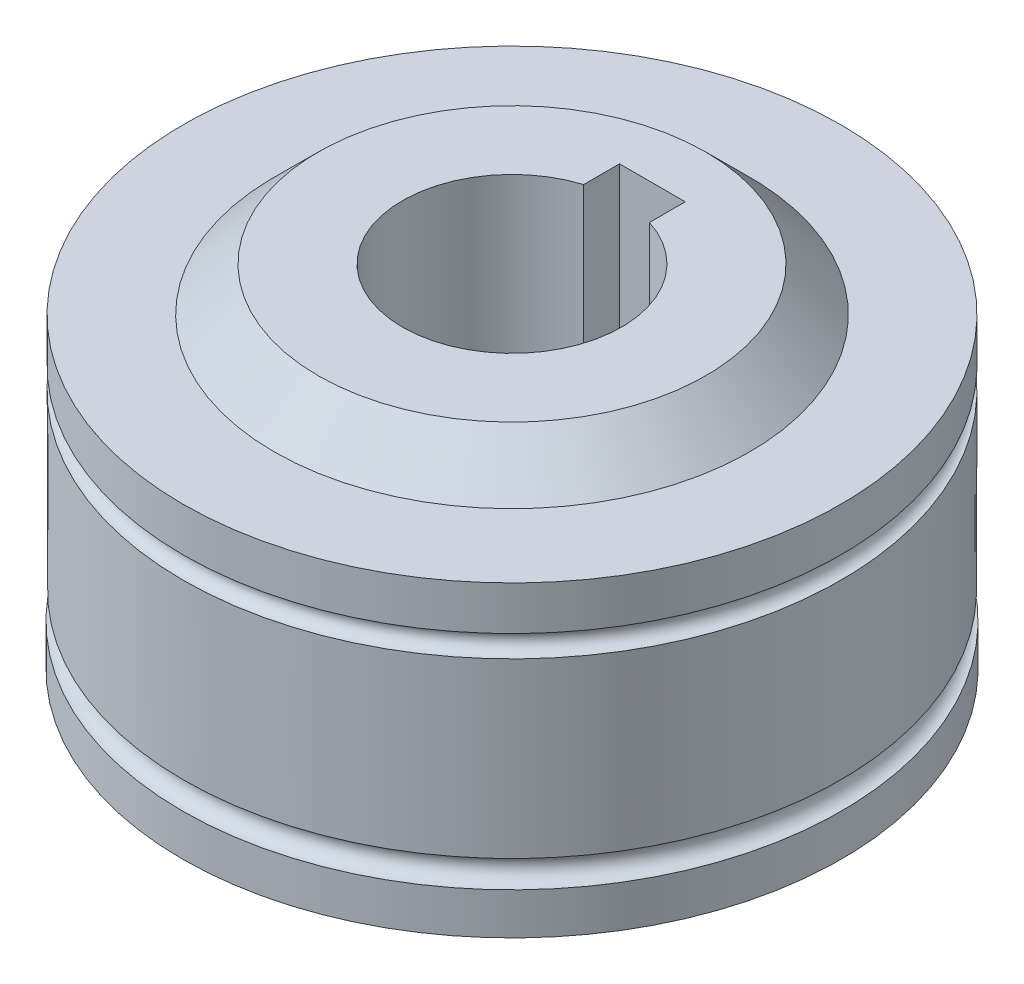
ISO-10303-21;
HEADER;
FILE_DESCRIPTION(('STEP AP214'),'2;1');
FILE_NAME('part.step','',(''),(''),'','','');
FILE_SCHEMA(('AUTOMOTIVE_DESIGN { 1 0 10303 214 1 1 1 1 }'));
ENDSEC;
DATA;
#1=APPLICATION_CONTEXT('core data for automotive mechanical design processes');
#2=APPLICATION_PROTOCOL_DEFINITION('international standard','automotive_design',2000,#1);
#3=PRODUCT_CONTEXT('',#1,'mechanical');
#4=PRODUCT('Part','Part','',(#3));
#5=PRODUCT_RELATED_PRODUCT_CATEGORY('part','',(#4));
#6=PRODUCT_DEFINITION_FORMATION('','',#4);
#7=PRODUCT_DEFINITION_CONTEXT('part definition',#1,'design');
#8=PRODUCT_DEFINITION('design','',#6,#7);
#9=PRODUCT_DEFINITION_SHAPE('','',#8);
#10=(LENGTH_UNIT() NAMED_UNIT(*) SI_UNIT(.MILLI.,.METRE.));
#11=(NAMED_UNIT(*) PLANE_ANGLE_UNIT() SI_UNIT($,.RADIAN.));
#12=(NAMED_UNIT(*) SI_UNIT($,.STERADIAN.) SOLID_ANGLE_UNIT());
#13=UNCERTAINTY_MEASURE_WITH_UNIT(LENGTH_MEASURE(1.E-05),#10,'distance_accuracy_value','');
#14=(GEOMETRIC_REPRESENTATION_CONTEXT(3) GLOBAL_UNCERTAINTY_ASSIGNED_CONTEXT((#13)) GLOBAL_UNIT_ASSIGNED_CONTEXT((#10,
#11,#12)) REPRESENTATION_CONTEXT('',''));
#15=CARTESIAN_POINT('',(0.,0.,0.));
#16=DIRECTION('',(0.,0.,1.));
#17=DIRECTION('',(1.,0.,0.));
#18=AXIS2_PLACEMENT_3D('',#15,#16,#17);
#19=CARTESIAN_POINT('',(0.,-9.,-8.84002342260273));
#20=DIRECTION('',(0.,-1.,0.));
#21=DIRECTION('',(0.,0.,-1.));
#22=AXIS2_PLACEMENT_3D('',#19,#20,#21);
#23=PLANE('',#22);
#24=DIRECTION('',(0.,0.,1.));
#25=VECTOR('',#24,1.);
#26=CARTESIAN_POINT('',(-1.5,-9.,-4.));
#27=LINE('',#26,#25);
#28=CARTESIAN_POINT('',(-1.5,-9.,-6.4056612472711));
#29=VERTEX_POINT('',#28);
#30=CARTESIAN_POINT('',(-1.5,-9.,-4.76969600708473));
#31=VERTEX_POINT('',#30);
#32=EDGE_CURVE('E93',#29,#31,#27,.T.);
#33=ORIENTED_EDGE('',*,*,#32,.T.);
#34=CARTESIAN_POINT('',(0.,-9.,0.));
#35=DIRECTION('',(0.,1.,0.));
#36=DIRECTION('',(0.,0.,1.));
#37=AXIS2_PLACEMENT_3D('',#34,#35,#36);
#38=CIRCLE('',#37,5.);
#39=CARTESIAN_POINT('',(1.5,-9.,-4.76969600708473));
#40=VERTEX_POINT('',#39);
#41=EDGE_CURVE('E103',#31,#40,#38,.T.);
#42=ORIENTED_EDGE('',*,*,#41,.T.);
#43=DIRECTION('',(0.,0.,-1.));
#44=VECTOR('',#43,1.);
#45=CARTESIAN_POINT('',(1.5,-9.,-6.4056612472711));
#46=LINE('',#45,#44);
#47=CARTESIAN_POINT('',(1.5,-9.,-6.4056612472711));
#48=VERTEX_POINT('',#47);
#49=EDGE_CURVE('E61',#40,#48,#46,.T.);
#50=ORIENTED_EDGE('',*,*,#49,.T.);
#51=DIRECTION('',(-1.,0.,0.));
#52=VECTOR('',#51,1.);
#53=CARTESIAN_POINT('',(-1.5,-9.,-6.4056612472711));
#54=LINE('',#53,#52);
#55=EDGE_CURVE('E96',#48,#29,#54,.T.);
#56=ORIENTED_EDGE('',*,*,#55,.T.);
#57=EDGE_LOOP('',(#33,#42,#50,#56));
#58=FACE_BOUND('',#57,.T.);
#59=CARTESIAN_POINT('',(0.,-8.99999999999999,0.));
#60=DIRECTION('',(0.,1.,0.));
#61=DIRECTION('',(0.,0.,1.));
#62=AXIS2_PLACEMENT_3D('',#59,#60,#61);
#63=CIRCLE('',#62,8.84002342260272);
#64=CARTESIAN_POINT('',(0.,-9.,8.84002342260272));
#65=VERTEX_POINT('',#64);
#66=EDGE_CURVE('E144',#65,#65,#63,.T.);
#67=ORIENTED_EDGE('',*,*,#66,.F.);
#68=EDGE_LOOP('',(#67));
#69=FACE_BOUND('',#68,.T.);
#70=ADVANCED_FACE('F47',(#58,#69),#23,.T.);
#71=CARTESIAN_POINT('',(0.,-7.,0.));
#72=DIRECTION('',(0.,1.,0.));
#73=DIRECTION('',(0.,0.,1.));
#74=AXIS2_PLACEMENT_3D('',#71,#72,#73);
#75=CONICAL_SURFACE('',#74,10.8508824151108,0.788105555005152);
#76=ORIENTED_EDGE('',*,*,#66,.T.);
#77=EDGE_LOOP('',(#76));
#78=FACE_BOUND('',#77,.T.);
#79=CARTESIAN_POINT('',(0.,-7.,0.));
#80=DIRECTION('',(0.,1.,0.));
#81=DIRECTION('',(0.,0.,1.));
#82=AXIS2_PLACEMENT_3D('',#79,#80,#81);
#83=CIRCLE('',#82,10.8508824151108);
#84=CARTESIAN_POINT('',(0.,-7.,10.8508824151108));
#85=VERTEX_POINT('',#84);
#86=EDGE_CURVE('E141',#85,#85,#83,.T.);
#87=ORIENTED_EDGE('',*,*,#86,.F.);
#88=EDGE_LOOP('',(#87));
#89=FACE_BOUND('',#88,.T.);
#90=ADVANCED_FACE('F165',(#78,#89),#75,.T.);
#91=CARTESIAN_POINT('',(0.,-7.,-15.0346090625599));
#92=DIRECTION('',(0.,-1.,0.));
#93=DIRECTION('',(0.,0.,-1.));
#94=AXIS2_PLACEMENT_3D('',#91,#92,#93);
#95=PLANE('',#94);
#96=ORIENTED_EDGE('',*,*,#86,.T.);
#97=EDGE_LOOP('',(#96));
#98=FACE_BOUND('',#97,.T.);
#99=CARTESIAN_POINT('',(0.,-7.,0.));
#100=DIRECTION('',(0.,1.,0.));
#101=DIRECTION('',(0.,0.,1.));
#102=AXIS2_PLACEMENT_3D('',#99,#100,#101);
#103=CIRCLE('',#102,15.0346090625599);
#104=CARTESIAN_POINT('',(0.,-7.,15.0346090625599));
#105=VERTEX_POINT('',#104);
#106=EDGE_CURVE('E138',#105,#105,#103,.T.);
#107=ORIENTED_EDGE('',*,*,#106,.F.);
#108=EDGE_LOOP('',(#107));
#109=FACE_BOUND('',#108,.T.);
#110=ADVANCED_FACE('F169',(#98,#109),#95,.T.);
#111=CARTESIAN_POINT('',(0.,26.6331730643921,0.));
#112=DIRECTION('',(0.,1.,0.));
#113=DIRECTION('',(0.,0.,1.));
#114=AXIS2_PLACEMENT_3D('',#111,#112,#113);
#115=CYLINDRICAL_SURFACE('',#114,15.0346090625599);
#116=CARTESIAN_POINT('',(0.,-5.09943827429824,0.));
#117=DIRECTION('',(0.,1.,0.));
#118=DIRECTION('',(0.,0.,1.));
#119=AXIS2_PLACEMENT_3D('',#116,#117,#118);
#120=CIRCLE('',#119,15.0346090625599);
#121=CARTESIAN_POINT('',(0.,-5.09943827429824,15.0346090625599));
#122=VERTEX_POINT('',#121);
#123=EDGE_CURVE('E135',#122,#122,#120,.T.);
#124=ORIENTED_EDGE('',*,*,#123,.F.);
#125=EDGE_LOOP('',(#124));
#126=FACE_BOUND('',#125,.T.);
#127=ORIENTED_EDGE('',*,*,#106,.T.);
#128=EDGE_LOOP('',(#127));
#129=FACE_BOUND('',#128,.T.);
#130=ADVANCED_FACE('F174',(#126,#129),#115,.T.);
#131=CARTESIAN_POINT('',(0.,-4.5,0.));
#132=DIRECTION('',(0.,1.,0.));
#133=DIRECTION('',(0.,0.,1.));
#134=AXIS2_PLACEMENT_3D('',#131,#132,#133);
#135=TOROIDAL_SURFACE('',#134,15.00865226564,0.600000000000001);
#136=CARTESIAN_POINT('',(0.,-3.90056172570176,0.));
#137=DIRECTION('',(0.,1.,0.));
#138=DIRECTION('',(0.,0.,1.));
#139=AXIS2_PLACEMENT_3D('',#136,#137,#138);
#140=CIRCLE('',#139,14.98269546872);
#141=CARTESIAN_POINT('',(0.,-3.90056172570176,14.98269546872));
#142=VERTEX_POINT('',#141);
#143=EDGE_CURVE('E132',#142,#142,#140,.T.);
#144=ORIENTED_EDGE('',*,*,#143,.F.);
#145=EDGE_LOOP('',(#144));
#146=FACE_BOUND('',#145,.T.);
#147=ORIENTED_EDGE('',*,*,#123,.T.);
#148=EDGE_LOOP('',(#147));
#149=FACE_BOUND('',#148,.T.);
#150=ADVANCED_FACE('F181',(#146,#149),#135,.F.);
#151=CARTESIAN_POINT('',(0.,4.,0.));
#152=DIRECTION('',(0.,1.,0.));
#153=DIRECTION('',(0.,0.,1.));
#154=AXIS2_PLACEMENT_3D('',#151,#152,#153);
#155=CONICAL_SURFACE('',#154,15.,0.00219028775531847);
#156=ORIENTED_EDGE('',*,*,#143,.T.);
#157=EDGE_LOOP('',(#156));
#158=FACE_BOUND('',#157,.T.);
#159=CARTESIAN_POINT('',(0.,4.,0.));
#160=DIRECTION('',(0.,1.,0.));
#161=DIRECTION('',(0.,0.,1.));
#162=AXIS2_PLACEMENT_3D('',#159,#160,#161);
#163=CIRCLE('',#162,15.);
#164=CARTESIAN_POINT('',(0.,3.99999999999999,15.));
#165=VERTEX_POINT('',#164);
#166=EDGE_CURVE('E129',#165,#165,#163,.T.);
#167=ORIENTED_EDGE('',*,*,#166,.F.);
#168=EDGE_LOOP('',(#167));
#169=FACE_BOUND('',#168,.T.);
#170=ADVANCED_FACE('F185',(#158,#169),#155,.T.);
#171=CARTESIAN_POINT('',(0.,4.5,0.));
#172=DIRECTION('',(0.,1.,0.));
#173=DIRECTION('',(0.,0.,1.));
#174=AXIS2_PLACEMENT_3D('',#171,#172,#173);
#175=TOROIDAL_SURFACE('',#174,15.,0.5);
#176=ORIENTED_EDGE('',*,*,#166,.T.);
#177=EDGE_LOOP('',(#176));
#178=FACE_BOUND('',#177,.T.);
#179=CARTESIAN_POINT('',(0.,4.99999999999999,0.));
#180=DIRECTION('',(0.,1.,0.));
#181=DIRECTION('',(0.,0.,1.));
#182=AXIS2_PLACEMENT_3D('',#179,#180,#181);
#183=CIRCLE('',#182,15.);
#184=CARTESIAN_POINT('',(0.,4.99999999999999,15.));
#185=VERTEX_POINT('',#184);
#186=EDGE_CURVE('E126',#185,#185,#183,.T.);
#187=ORIENTED_EDGE('',*,*,#186,.F.);
#188=EDGE_LOOP('',(#187));
#189=FACE_BOUND('',#188,.T.);
#190=ADVANCED_FACE('F189',(#178,#189),#175,.F.);
#191=CARTESIAN_POINT('',(0.,26.6331730643921,0.));
#192=DIRECTION('',(0.,1.,0.));
#193=DIRECTION('',(0.,0.,1.));
#194=AXIS2_PLACEMENT_3D('',#191,#192,#193);
#195=CYLINDRICAL_SURFACE('',#194,15.);
#196=ORIENTED_EDGE('',*,*,#186,.T.);
#197=EDGE_LOOP('',(#196));
#198=FACE_BOUND('',#197,.T.);
#199=CARTESIAN_POINT('',(0.,7.,0.));
#200=DIRECTION('',(0.,1.,0.));
#201=DIRECTION('',(0.,0.,1.));
#202=AXIS2_PLACEMENT_3D('',#199,#200,#201);
#203=CIRCLE('',#202,15.);
#204=CARTESIAN_POINT('',(0.,6.99999999999999,15.));
#205=VERTEX_POINT('',#204);
#206=EDGE_CURVE('E123',#205,#205,#203,.T.);
#207=ORIENTED_EDGE('',*,*,#206,.F.);
#208=EDGE_LOOP('',(#207));
#209=FACE_BOUND('',#208,.T.);
#210=ADVANCED_FACE('F193',(#198,#209),#195,.T.);
#211=CARTESIAN_POINT('',(0.,7.,-15.));
#212=DIRECTION('',(0.,-1.,0.));
#213=DIRECTION('',(0.,0.,-1.));
#214=AXIS2_PLACEMENT_3D('',#211,#212,#213);
#215=PLANE('',#214);
#216=CARTESIAN_POINT('',(0.,7.,0.));
#217=DIRECTION('',(0.,1.,0.));
#218=DIRECTION('',(0.,0.,1.));
#219=AXIS2_PLACEMENT_3D('',#216,#217,#218);
#220=CIRCLE('',#219,10.8508824151108);
#221=CARTESIAN_POINT('',(0.,7.,10.8508824151108));
#222=VERTEX_POINT('',#221);
#223=EDGE_CURVE('E120',#222,#222,#220,.T.);
#224=ORIENTED_EDGE('',*,*,#223,.F.);
#225=EDGE_LOOP('',(#224));
#226=FACE_BOUND('',#225,.T.);
#227=ORIENTED_EDGE('',*,*,#206,.T.);
#228=EDGE_LOOP('',(#227));
#229=FACE_BOUND('',#228,.T.);
#230=ADVANCED_FACE('F197',(#226,#229),#215,.F.);
#231=CARTESIAN_POINT('',(0.,7.,0.));
#232=DIRECTION('',(0.,-1.,0.));
#233=DIRECTION('',(0.,0.,-1.));
#234=AXIS2_PLACEMENT_3D('',#231,#232,#233);
#235=CONICAL_SURFACE('',#234,10.8508824151108,0.788105555005151);
#236=CARTESIAN_POINT('',(0.,9.,0.));
#237=DIRECTION('',(0.,1.,0.));
#238=DIRECTION('',(0.,0.,1.));
#239=AXIS2_PLACEMENT_3D('',#236,#237,#238);
#240=CIRCLE('',#239,8.84002342260273);
#241=CARTESIAN_POINT('',(0.,9.,8.84002342260273));
#242=VERTEX_POINT('',#241);
#243=EDGE_CURVE('E117',#242,#242,#240,.T.);
#244=ORIENTED_EDGE('',*,*,#243,.F.);
#245=EDGE_LOOP('',(#244));
#246=FACE_BOUND('',#245,.T.);
#247=ORIENTED_EDGE('',*,*,#223,.T.);
#248=EDGE_LOOP('',(#247));
#249=FACE_BOUND('',#248,.T.);
#250=ADVANCED_FACE('F161',(#246,#249),#235,.T.);
#251=CARTESIAN_POINT('',(0.,9.,-8.84002342260273));
#252=DIRECTION('',(0.,-1.,0.));
#253=DIRECTION('',(0.,0.,-1.));
#254=AXIS2_PLACEMENT_3D('',#251,#252,#253);
#255=PLANE('',#254);
#256=CARTESIAN_POINT('',(0.,9.,0.));
#257=DIRECTION('',(0.,1.,0.));
#258=DIRECTION('',(0.,0.,1.));
#259=AXIS2_PLACEMENT_3D('',#256,#257,#258);
#260=CIRCLE('',#259,5.);
#261=CARTESIAN_POINT('',(-1.5,8.99999999999999,-4.76969600708473));
#262=VERTEX_POINT('',#261);
#263=CARTESIAN_POINT('',(1.5,8.99999999999999,-4.76969600708473));
#264=VERTEX_POINT('',#263);
#265=EDGE_CURVE('E114',#262,#264,#260,.T.);
#266=ORIENTED_EDGE('',*,*,#265,.F.);
#267=DIRECTION('',(0.,0.,1.));
#268=VECTOR('',#267,1.);
#269=CARTESIAN_POINT('',(-1.5,9.,-4.));
#270=LINE('',#269,#268);
#271=CARTESIAN_POINT('',(-1.5,9.,-6.4056612472711));
#272=VERTEX_POINT('',#271);
#273=EDGE_CURVE('E104',#272,#262,#270,.T.);
#274=ORIENTED_EDGE('',*,*,#273,.F.);
#275=DIRECTION('',(-1.,0.,0.));
#276=VECTOR('',#275,1.);
#277=CARTESIAN_POINT('',(-1.5,9.,-6.4056612472711));
#278=LINE('',#277,#276);
#279=CARTESIAN_POINT('',(1.5,9.,-6.4056612472711));
#280=VERTEX_POINT('',#279);
#281=EDGE_CURVE('E106',#280,#272,#278,.T.);
#282=ORIENTED_EDGE('',*,*,#281,.F.);
#283=DIRECTION('',(0.,0.,-1.));
#284=VECTOR('',#283,1.);
#285=CARTESIAN_POINT('',(1.5,9.,-6.4056612472711));
#286=LINE('',#285,#284);
#287=EDGE_CURVE('E88',#264,#280,#286,.T.);
#288=ORIENTED_EDGE('',*,*,#287,.F.);
#289=EDGE_LOOP('',(#266,#274,#282,#288));
#290=FACE_BOUND('',#289,.T.);
#291=ORIENTED_EDGE('',*,*,#243,.T.);
#292=EDGE_LOOP('',(#291));
#293=FACE_BOUND('',#292,.T.);
#294=ADVANCED_FACE('F149',(#290,#293),#255,.F.);
#295=CARTESIAN_POINT('',(0.,26.6331730643921,0.));
#296=DIRECTION('',(0.,1.,0.));
#297=DIRECTION('',(0.,0.,1.));
#298=AXIS2_PLACEMENT_3D('',#295,#296,#297);
#299=CYLINDRICAL_SURFACE('',#298,5.);
#300=DIRECTION('',(0.,1.,0.));
#301=VECTOR('',#300,1.);
#302=CARTESIAN_POINT('',(-1.5,26.6331730643921,-4.76969600708473));
#303=LINE('',#302,#301);
#304=EDGE_CURVE('E13',#262,#31,#303,.F.);
#305=ORIENTED_EDGE('',*,*,#304,.F.);
#306=ORIENTED_EDGE('',*,*,#265,.T.);
#307=DIRECTION('',(0.,1.,0.));
#308=VECTOR('',#307,1.);
#309=CARTESIAN_POINT('',(1.5,26.6331730643921,-4.76969600708473));
#310=LINE('',#309,#308);
#311=EDGE_CURVE('E54',#40,#264,#310,.T.);
#312=ORIENTED_EDGE('',*,*,#311,.F.);
#313=ORIENTED_EDGE('',*,*,#41,.F.);
#314=EDGE_LOOP('',(#305,#306,#312,#313));
#315=FACE_BOUND('',#314,.T.);
#316=ADVANCED_FACE('F152',(#315),#299,.F.);
#317=CARTESIAN_POINT('',(-1.5,-9.,-4.));
#318=DIRECTION('',(-1.,0.,0.));
#319=DIRECTION('',(0.,0.,1.));
#320=AXIS2_PLACEMENT_3D('',#317,#318,#319);
#321=PLANE('',#320);
#322=ORIENTED_EDGE('',*,*,#304,.T.);
#323=ORIENTED_EDGE('',*,*,#32,.F.);
#324=DIRECTION('',(0.,1.,0.));
#325=VECTOR('',#324,1.);
#326=CARTESIAN_POINT('',(-1.5,-9.,-6.4056612472711));
#327=LINE('',#326,#325);
#328=EDGE_CURVE('E92',#29,#272,#327,.T.);
#329=ORIENTED_EDGE('',*,*,#328,.T.);
#330=ORIENTED_EDGE('',*,*,#273,.T.);
#331=EDGE_LOOP('',(#322,#323,#329,#330));
#332=FACE_BOUND('',#331,.T.);
#333=ADVANCED_FACE('F154',(#332),#321,.F.);
#334=CARTESIAN_POINT('',(-1.5,-9.,-6.4056612472711));
#335=DIRECTION('',(0.,0.,-1.));
#336=DIRECTION('',(0.,1.,0.));
#337=AXIS2_PLACEMENT_3D('',#334,#335,#336);
#338=PLANE('',#337);
#339=ORIENTED_EDGE('',*,*,#281,.T.);
#340=ORIENTED_EDGE('',*,*,#328,.F.);
#341=ORIENTED_EDGE('',*,*,#55,.F.);
#342=DIRECTION('',(0.,1.,0.));
#343=VECTOR('',#342,1.);
#344=CARTESIAN_POINT('',(1.5,-9.,-6.4056612472711));
#345=LINE('',#344,#343);
#346=EDGE_CURVE('E84',#48,#280,#345,.T.);
#347=ORIENTED_EDGE('',*,*,#346,.T.);
#348=EDGE_LOOP('',(#339,#340,#341,#347));
#349=FACE_BOUND('',#348,.T.);
#350=ADVANCED_FACE('F97',(#349),#338,.F.);
#351=CARTESIAN_POINT('',(1.5,-9.,-6.4056612472711));
#352=DIRECTION('',(1.,0.,0.));
#353=DIRECTION('',(0.,0.,-1.));
#354=AXIS2_PLACEMENT_3D('',#351,#352,#353);
#355=PLANE('',#354);
#356=ORIENTED_EDGE('',*,*,#311,.T.);
#357=ORIENTED_EDGE('',*,*,#287,.T.);
#358=ORIENTED_EDGE('',*,*,#346,.F.);
#359=ORIENTED_EDGE('',*,*,#49,.F.);
#360=EDGE_LOOP('',(#356,#357,#358,#359));
#361=FACE_BOUND('',#360,.T.);
#362=ADVANCED_FACE('F86',(#361),#355,.F.);
#363=CLOSED_SHELL('',(#70,#90,#110,#130,#150,#170,#190,#210,#230,#250,#294,#316,#333,#350,#362));
#364=MANIFOLD_SOLID_BREP('B2',#363);
#365=ADVANCED_BREP_SHAPE_REPRESENTATION('',(#18,#364),#14);
#366=SHAPE_DEFINITION_REPRESENTATION(#9,#365);
ENDSEC;
END-ISO-10303-21;
